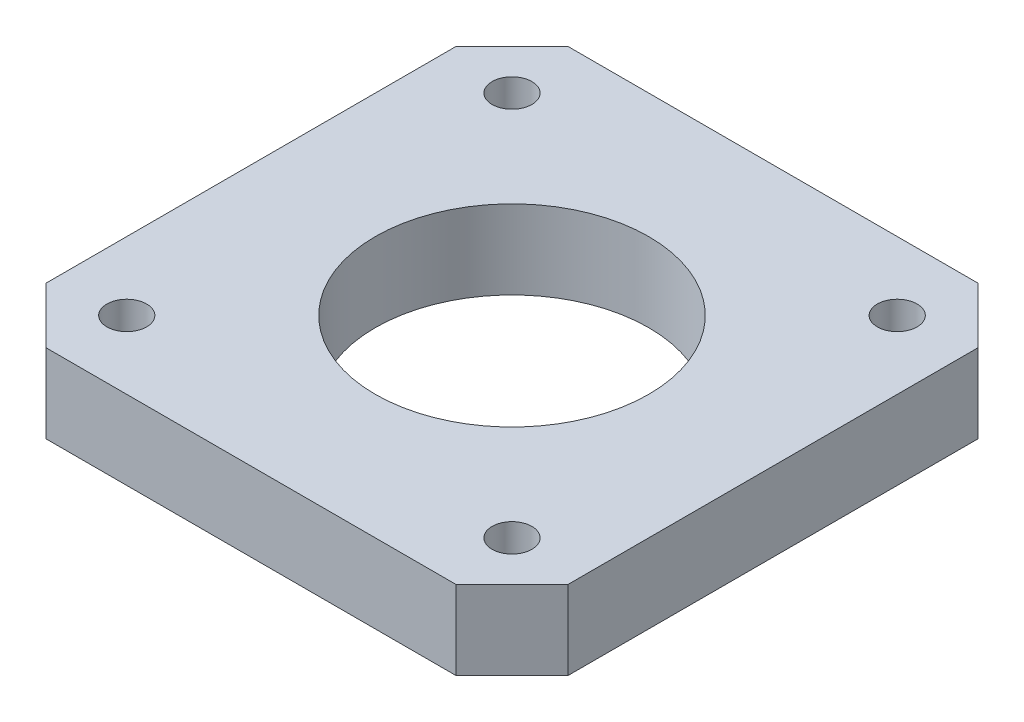
ISO-10303-21;
HEADER;
FILE_DESCRIPTION(('STEP AP214'),'2;1');
FILE_NAME('part.step','',(''),(''),'','','');
FILE_SCHEMA(('AUTOMOTIVE_DESIGN { 1 0 10303 214 1 1 1 1 }'));
ENDSEC;
DATA;
#1=APPLICATION_CONTEXT('core data for automotive mechanical design processes');
#2=APPLICATION_PROTOCOL_DEFINITION('international standard','automotive_design',2000,#1);
#3=PRODUCT_CONTEXT('',#1,'mechanical');
#4=PRODUCT('Part','Part','',(#3));
#5=PRODUCT_RELATED_PRODUCT_CATEGORY('part','',(#4));
#6=PRODUCT_DEFINITION_FORMATION('','',#4);
#7=PRODUCT_DEFINITION_CONTEXT('part definition',#1,'design');
#8=PRODUCT_DEFINITION('design','',#6,#7);
#9=PRODUCT_DEFINITION_SHAPE('','',#8);
#10=(LENGTH_UNIT() NAMED_UNIT(*) SI_UNIT(.MILLI.,.METRE.));
#11=(NAMED_UNIT(*) PLANE_ANGLE_UNIT() SI_UNIT($,.RADIAN.));
#12=(NAMED_UNIT(*) SI_UNIT($,.STERADIAN.) SOLID_ANGLE_UNIT());
#13=UNCERTAINTY_MEASURE_WITH_UNIT(LENGTH_MEASURE(1.E-05),#10,'distance_accuracy_value','');
#14=(GEOMETRIC_REPRESENTATION_CONTEXT(3) GLOBAL_UNCERTAINTY_ASSIGNED_CONTEXT((#13)) GLOBAL_UNIT_ASSIGNED_CONTEXT((#10,
#11,#12)) REPRESENTATION_CONTEXT('',''));
#15=CARTESIAN_POINT('',(0.,0.,0.));
#16=DIRECTION('',(0.,0.,1.));
#17=DIRECTION('',(1.,0.,0.));
#18=AXIS2_PLACEMENT_3D('',#15,#16,#17);
#19=CARTESIAN_POINT('',(-21.,6.35,21.));
#20=DIRECTION('',(0.,0.,-1.));
#21=DIRECTION('',(-1.,0.,0.));
#22=AXIS2_PLACEMENT_3D('',#19,#20,#21);
#23=PLANE('',#22);
#24=DIRECTION('',(1.,0.,0.));
#25=VECTOR('',#24,1.);
#26=CARTESIAN_POINT('',(-21.,0.,21.));
#27=LINE('',#26,#25);
#28=CARTESIAN_POINT('',(-16.5,0.,21.));
#29=VERTEX_POINT('',#28);
#30=CARTESIAN_POINT('',(16.5,0.,21.));
#31=VERTEX_POINT('',#30);
#32=EDGE_CURVE('E128',#29,#31,#27,.T.);
#33=ORIENTED_EDGE('',*,*,#32,.T.);
#34=DIRECTION('',(0.,1.,0.));
#35=VECTOR('',#34,1.);
#36=CARTESIAN_POINT('',(16.5,6.35,21.));
#37=LINE('',#36,#35);
#38=CARTESIAN_POINT('',(16.5,6.35,21.));
#39=VERTEX_POINT('',#38);
#40=EDGE_CURVE('E105',#31,#39,#37,.T.);
#41=ORIENTED_EDGE('',*,*,#40,.T.);
#42=DIRECTION('',(1.,0.,0.));
#43=VECTOR('',#42,1.);
#44=CARTESIAN_POINT('',(-21.,6.35,21.));
#45=LINE('',#44,#43);
#46=CARTESIAN_POINT('',(-16.5,6.35,21.));
#47=VERTEX_POINT('',#46);
#48=EDGE_CURVE('E138',#47,#39,#45,.T.);
#49=ORIENTED_EDGE('',*,*,#48,.F.);
#50=DIRECTION('',(0.,-1.,0.));
#51=VECTOR('',#50,1.);
#52=CARTESIAN_POINT('',(-16.5,6.35,21.));
#53=LINE('',#52,#51);
#54=EDGE_CURVE('E110',#47,#29,#53,.T.);
#55=ORIENTED_EDGE('',*,*,#54,.T.);
#56=EDGE_LOOP('',(#33,#41,#49,#55));
#57=FACE_BOUND('',#56,.T.);
#58=ADVANCED_FACE('F33',(#57),#23,.F.);
#59=CARTESIAN_POINT('',(21.,6.35,21.));
#60=DIRECTION('',(-1.,0.,0.));
#61=DIRECTION('',(0.,0.,1.));
#62=AXIS2_PLACEMENT_3D('',#59,#60,#61);
#63=PLANE('',#62);
#64=DIRECTION('',(0.,0.,-1.));
#65=VECTOR('',#64,1.);
#66=CARTESIAN_POINT('',(21.,6.35,21.));
#67=LINE('',#66,#65);
#68=CARTESIAN_POINT('',(21.,6.35,16.5));
#69=VERTEX_POINT('',#68);
#70=CARTESIAN_POINT('',(21.,6.35,-16.5));
#71=VERTEX_POINT('',#70);
#72=EDGE_CURVE('E120',#69,#71,#67,.T.);
#73=ORIENTED_EDGE('',*,*,#72,.F.);
#74=DIRECTION('',(0.,-1.,0.));
#75=VECTOR('',#74,1.);
#76=CARTESIAN_POINT('',(21.,6.35,16.5));
#77=LINE('',#76,#75);
#78=CARTESIAN_POINT('',(21.,0.,16.5));
#79=VERTEX_POINT('',#78);
#80=EDGE_CURVE('E104',#69,#79,#77,.T.);
#81=ORIENTED_EDGE('',*,*,#80,.T.);
#82=DIRECTION('',(0.,0.,-1.));
#83=VECTOR('',#82,1.);
#84=CARTESIAN_POINT('',(21.,0.,21.));
#85=LINE('',#84,#83);
#86=CARTESIAN_POINT('',(21.,0.,-16.5));
#87=VERTEX_POINT('',#86);
#88=EDGE_CURVE('E117',#79,#87,#85,.T.);
#89=ORIENTED_EDGE('',*,*,#88,.T.);
#90=DIRECTION('',(0.,1.,0.));
#91=VECTOR('',#90,1.);
#92=CARTESIAN_POINT('',(21.,6.35,-16.5));
#93=LINE('',#92,#91);
#94=EDGE_CURVE('E122',#87,#71,#93,.T.);
#95=ORIENTED_EDGE('',*,*,#94,.T.);
#96=EDGE_LOOP('',(#73,#81,#89,#95));
#97=FACE_BOUND('',#96,.T.);
#98=ADVANCED_FACE('F116',(#97),#63,.F.);
#99=CARTESIAN_POINT('',(-21.,6.35,-21.));
#100=DIRECTION('',(0.,0.,1.));
#101=DIRECTION('',(1.,0.,0.));
#102=AXIS2_PLACEMENT_3D('',#99,#100,#101);
#103=PLANE('',#102);
#104=DIRECTION('',(-1.,0.,0.));
#105=VECTOR('',#104,1.);
#106=CARTESIAN_POINT('',(-21.,6.35,-21.));
#107=LINE('',#106,#105);
#108=CARTESIAN_POINT('',(16.5,6.35,-21.));
#109=VERTEX_POINT('',#108);
#110=CARTESIAN_POINT('',(-16.5,6.35,-21.));
#111=VERTEX_POINT('',#110);
#112=EDGE_CURVE('E161',#109,#111,#107,.T.);
#113=ORIENTED_EDGE('',*,*,#112,.F.);
#114=DIRECTION('',(0.,-1.,0.));
#115=VECTOR('',#114,1.);
#116=CARTESIAN_POINT('',(16.5,6.35,-21.));
#117=LINE('',#116,#115);
#118=CARTESIAN_POINT('',(16.5,0.,-21.));
#119=VERTEX_POINT('',#118);
#120=EDGE_CURVE('E11',#109,#119,#117,.T.);
#121=ORIENTED_EDGE('',*,*,#120,.T.);
#122=DIRECTION('',(-1.,0.,0.));
#123=VECTOR('',#122,1.);
#124=CARTESIAN_POINT('',(-21.,0.,-21.));
#125=LINE('',#124,#123);
#126=CARTESIAN_POINT('',(-16.5,0.,-21.));
#127=VERTEX_POINT('',#126);
#128=EDGE_CURVE('E127',#119,#127,#125,.T.);
#129=ORIENTED_EDGE('',*,*,#128,.T.);
#130=DIRECTION('',(0.,1.,0.));
#131=VECTOR('',#130,1.);
#132=CARTESIAN_POINT('',(-16.5,6.35,-21.));
#133=LINE('',#132,#131);
#134=EDGE_CURVE('E41',#127,#111,#133,.T.);
#135=ORIENTED_EDGE('',*,*,#134,.T.);
#136=EDGE_LOOP('',(#113,#121,#129,#135));
#137=FACE_BOUND('',#136,.T.);
#138=ADVANCED_FACE('F160',(#137),#103,.F.);
#139=CARTESIAN_POINT('',(-21.,6.35,21.));
#140=DIRECTION('',(1.,0.,0.));
#141=DIRECTION('',(0.,0.,-1.));
#142=AXIS2_PLACEMENT_3D('',#139,#140,#141);
#143=PLANE('',#142);
#144=DIRECTION('',(0.,0.,1.));
#145=VECTOR('',#144,1.);
#146=CARTESIAN_POINT('',(-21.,0.,21.));
#147=LINE('',#146,#145);
#148=CARTESIAN_POINT('',(-21.,0.,-16.5));
#149=VERTEX_POINT('',#148);
#150=CARTESIAN_POINT('',(-21.,0.,16.5));
#151=VERTEX_POINT('',#150);
#152=EDGE_CURVE('E131',#149,#151,#147,.T.);
#153=ORIENTED_EDGE('',*,*,#152,.T.);
#154=DIRECTION('',(0.,1.,0.));
#155=VECTOR('',#154,1.);
#156=CARTESIAN_POINT('',(-21.,6.35,16.5));
#157=LINE('',#156,#155);
#158=CARTESIAN_POINT('',(-21.,6.35,16.5));
#159=VERTEX_POINT('',#158);
#160=EDGE_CURVE('E48',#151,#159,#157,.T.);
#161=ORIENTED_EDGE('',*,*,#160,.T.);
#162=DIRECTION('',(0.,0.,1.));
#163=VECTOR('',#162,1.);
#164=CARTESIAN_POINT('',(-21.,6.35,21.));
#165=LINE('',#164,#163);
#166=CARTESIAN_POINT('',(-21.,6.35,-16.5));
#167=VERTEX_POINT('',#166);
#168=EDGE_CURVE('E139',#167,#159,#165,.T.);
#169=ORIENTED_EDGE('',*,*,#168,.F.);
#170=DIRECTION('',(0.,-1.,0.));
#171=VECTOR('',#170,1.);
#172=CARTESIAN_POINT('',(-21.,6.35,-16.5));
#173=LINE('',#172,#171);
#174=EDGE_CURVE('E154',#167,#149,#173,.T.);
#175=ORIENTED_EDGE('',*,*,#174,.T.);
#176=EDGE_LOOP('',(#153,#161,#169,#175));
#177=FACE_BOUND('',#176,.T.);
#178=ADVANCED_FACE('F170',(#177),#143,.F.);
#179=CARTESIAN_POINT('',(0.,6.35,0.));
#180=DIRECTION('',(0.,1.,0.));
#181=DIRECTION('',(0.,0.,1.));
#182=AXIS2_PLACEMENT_3D('',#179,#180,#181);
#183=PLANE('',#182);
#184=CARTESIAN_POINT('',(0.,6.35,0.));
#185=DIRECTION('',(0.,1.,0.));
#186=DIRECTION('',(0.,0.,1.));
#187=AXIS2_PLACEMENT_3D('',#184,#185,#186);
#188=CIRCLE('',#187,11.);
#189=CARTESIAN_POINT('',(0.,6.35,11.));
#190=VERTEX_POINT('',#189);
#191=EDGE_CURVE('E204',#190,#190,#188,.T.);
#192=ORIENTED_EDGE('',*,*,#191,.F.);
#193=EDGE_LOOP('',(#192));
#194=FACE_BOUND('',#193,.T.);
#195=CARTESIAN_POINT('',(-15.5,6.35,-15.5));
#196=DIRECTION('',(0.,1.,0.));
#197=DIRECTION('',(0.,0.,1.));
#198=AXIS2_PLACEMENT_3D('',#195,#196,#197);
#199=CIRCLE('',#198,1.59999999999999);
#200=CARTESIAN_POINT('',(-15.5,6.35,-13.9));
#201=VERTEX_POINT('',#200);
#202=EDGE_CURVE('E200',#201,#201,#199,.T.);
#203=ORIENTED_EDGE('',*,*,#202,.F.);
#204=EDGE_LOOP('',(#203));
#205=FACE_BOUND('',#204,.T.);
#206=CARTESIAN_POINT('',(-15.5,6.35,15.5));
#207=DIRECTION('',(0.,1.,0.));
#208=DIRECTION('',(0.,0.,1.));
#209=AXIS2_PLACEMENT_3D('',#206,#207,#208);
#210=CIRCLE('',#209,1.59999999999999);
#211=CARTESIAN_POINT('',(-15.5,6.35,17.1));
#212=VERTEX_POINT('',#211);
#213=EDGE_CURVE('E194',#212,#212,#210,.T.);
#214=ORIENTED_EDGE('',*,*,#213,.F.);
#215=EDGE_LOOP('',(#214));
#216=FACE_BOUND('',#215,.T.);
#217=CARTESIAN_POINT('',(15.5,6.35,15.5));
#218=DIRECTION('',(0.,1.,0.));
#219=DIRECTION('',(0.,0.,1.));
#220=AXIS2_PLACEMENT_3D('',#217,#218,#219);
#221=CIRCLE('',#220,1.59999999999999);
#222=CARTESIAN_POINT('',(15.5,6.35,17.1));
#223=VERTEX_POINT('',#222);
#224=EDGE_CURVE('E188',#223,#223,#221,.T.);
#225=ORIENTED_EDGE('',*,*,#224,.F.);
#226=EDGE_LOOP('',(#225));
#227=FACE_BOUND('',#226,.T.);
#228=CARTESIAN_POINT('',(15.5,6.35,-15.5));
#229=DIRECTION('',(0.,1.,0.));
#230=DIRECTION('',(0.,0.,1.));
#231=AXIS2_PLACEMENT_3D('',#228,#229,#230);
#232=CIRCLE('',#231,1.59999999999999);
#233=CARTESIAN_POINT('',(15.5,6.35,-13.9));
#234=VERTEX_POINT('',#233);
#235=EDGE_CURVE('E182',#234,#234,#232,.T.);
#236=ORIENTED_EDGE('',*,*,#235,.F.);
#237=EDGE_LOOP('',(#236));
#238=FACE_BOUND('',#237,.T.);
#239=ORIENTED_EDGE('',*,*,#48,.T.);
#240=DIRECTION('',(-0.707106781186549,0.,0.707106781186546));
#241=VECTOR('',#240,1.);
#242=CARTESIAN_POINT('',(18.75,6.35,18.75));
#243=LINE('',#242,#241);
#244=EDGE_CURVE('E152',#39,#69,#243,.F.);
#245=ORIENTED_EDGE('',*,*,#244,.T.);
#246=ORIENTED_EDGE('',*,*,#72,.T.);
#247=DIRECTION('',(0.707106781186546,0.,0.707106781186549));
#248=VECTOR('',#247,1.);
#249=CARTESIAN_POINT('',(18.75,6.35,-18.75));
#250=LINE('',#249,#248);
#251=EDGE_CURVE('E148',#71,#109,#250,.F.);
#252=ORIENTED_EDGE('',*,*,#251,.T.);
#253=ORIENTED_EDGE('',*,*,#112,.T.);
#254=DIRECTION('',(0.707106781186549,0.,-0.707106781186546));
#255=VECTOR('',#254,1.);
#256=CARTESIAN_POINT('',(-18.75,6.35,-18.75));
#257=LINE('',#256,#255);
#258=EDGE_CURVE('E55',#111,#167,#257,.F.);
#259=ORIENTED_EDGE('',*,*,#258,.T.);
#260=ORIENTED_EDGE('',*,*,#168,.T.);
#261=DIRECTION('',(-0.707106781186546,0.,-0.707106781186549));
#262=VECTOR('',#261,1.);
#263=CARTESIAN_POINT('',(-18.75,6.35,18.75));
#264=LINE('',#263,#262);
#265=EDGE_CURVE('E150',#159,#47,#264,.F.);
#266=ORIENTED_EDGE('',*,*,#265,.T.);
#267=EDGE_LOOP('',(#239,#245,#246,#252,#253,#259,#260,#266));
#268=FACE_BOUND('',#267,.T.);
#269=ADVANCED_FACE('F165',(#194,#205,#216,#227,#238,#268),#183,.T.);
#270=CARTESIAN_POINT('',(0.,0.,0.));
#271=DIRECTION('',(0.,1.,0.));
#272=DIRECTION('',(0.,0.,1.));
#273=AXIS2_PLACEMENT_3D('',#270,#271,#272);
#274=PLANE('',#273);
#275=CARTESIAN_POINT('',(0.,0.,0.));
#276=DIRECTION('',(0.,1.,0.));
#277=DIRECTION('',(0.,0.,1.));
#278=AXIS2_PLACEMENT_3D('',#275,#276,#277);
#279=CIRCLE('',#278,11.);
#280=CARTESIAN_POINT('',(0.,0.,11.));
#281=VERTEX_POINT('',#280);
#282=EDGE_CURVE('E203',#281,#281,#279,.T.);
#283=ORIENTED_EDGE('',*,*,#282,.T.);
#284=EDGE_LOOP('',(#283));
#285=FACE_BOUND('',#284,.T.);
#286=CARTESIAN_POINT('',(-15.5,0.,-15.5));
#287=DIRECTION('',(0.,1.,0.));
#288=DIRECTION('',(0.,0.,1.));
#289=AXIS2_PLACEMENT_3D('',#286,#287,#288);
#290=CIRCLE('',#289,1.6);
#291=CARTESIAN_POINT('',(-15.5,0.,-13.9));
#292=VERTEX_POINT('',#291);
#293=EDGE_CURVE('E197',#292,#292,#290,.T.);
#294=ORIENTED_EDGE('',*,*,#293,.T.);
#295=EDGE_LOOP('',(#294));
#296=FACE_BOUND('',#295,.T.);
#297=CARTESIAN_POINT('',(-15.5,0.,15.5));
#298=DIRECTION('',(0.,1.,0.));
#299=DIRECTION('',(0.,0.,1.));
#300=AXIS2_PLACEMENT_3D('',#297,#298,#299);
#301=CIRCLE('',#300,1.6);
#302=CARTESIAN_POINT('',(-15.5,0.,17.1));
#303=VERTEX_POINT('',#302);
#304=EDGE_CURVE('E191',#303,#303,#301,.T.);
#305=ORIENTED_EDGE('',*,*,#304,.T.);
#306=EDGE_LOOP('',(#305));
#307=FACE_BOUND('',#306,.T.);
#308=CARTESIAN_POINT('',(15.5,0.,15.5));
#309=DIRECTION('',(0.,1.,0.));
#310=DIRECTION('',(0.,0.,1.));
#311=AXIS2_PLACEMENT_3D('',#308,#309,#310);
#312=CIRCLE('',#311,1.6);
#313=CARTESIAN_POINT('',(15.5,0.,17.1));
#314=VERTEX_POINT('',#313);
#315=EDGE_CURVE('E185',#314,#314,#312,.T.);
#316=ORIENTED_EDGE('',*,*,#315,.T.);
#317=EDGE_LOOP('',(#316));
#318=FACE_BOUND('',#317,.T.);
#319=CARTESIAN_POINT('',(15.5,0.,-15.5));
#320=DIRECTION('',(0.,1.,0.));
#321=DIRECTION('',(0.,0.,1.));
#322=AXIS2_PLACEMENT_3D('',#319,#320,#321);
#323=CIRCLE('',#322,1.6);
#324=CARTESIAN_POINT('',(15.5,0.,-13.9));
#325=VERTEX_POINT('',#324);
#326=EDGE_CURVE('E133',#325,#325,#323,.T.);
#327=ORIENTED_EDGE('',*,*,#326,.T.);
#328=EDGE_LOOP('',(#327));
#329=FACE_BOUND('',#328,.T.);
#330=ORIENTED_EDGE('',*,*,#88,.F.);
#331=DIRECTION('',(0.707106781186549,0.,-0.707106781186546));
#332=VECTOR('',#331,1.);
#333=CARTESIAN_POINT('',(21.,0.,16.5));
#334=LINE('',#333,#332);
#335=EDGE_CURVE('E100',#79,#31,#334,.F.);
#336=ORIENTED_EDGE('',*,*,#335,.T.);
#337=ORIENTED_EDGE('',*,*,#32,.F.);
#338=DIRECTION('',(0.707106781186546,0.,0.707106781186549));
#339=VECTOR('',#338,1.);
#340=CARTESIAN_POINT('',(-16.5,0.,21.));
#341=LINE('',#340,#339);
#342=EDGE_CURVE('E111',#29,#151,#341,.F.);
#343=ORIENTED_EDGE('',*,*,#342,.T.);
#344=ORIENTED_EDGE('',*,*,#152,.F.);
#345=DIRECTION('',(-0.707106781186549,0.,0.707106781186546));
#346=VECTOR('',#345,1.);
#347=CARTESIAN_POINT('',(-21.,0.,-16.5));
#348=LINE('',#347,#346);
#349=EDGE_CURVE('E121',#149,#127,#348,.F.);
#350=ORIENTED_EDGE('',*,*,#349,.T.);
#351=ORIENTED_EDGE('',*,*,#128,.F.);
#352=DIRECTION('',(-0.707106781186546,0.,-0.707106781186549));
#353=VECTOR('',#352,1.);
#354=CARTESIAN_POINT('',(16.5,0.,-21.));
#355=LINE('',#354,#353);
#356=EDGE_CURVE('E126',#119,#87,#355,.F.);
#357=ORIENTED_EDGE('',*,*,#356,.T.);
#358=EDGE_LOOP('',(#330,#336,#337,#343,#344,#350,#351,#357));
#359=FACE_BOUND('',#358,.T.);
#360=ADVANCED_FACE('F124',(#285,#296,#307,#318,#329,#359),#274,.F.);
#361=CARTESIAN_POINT('',(21.,6.35,16.5));
#362=DIRECTION('',(-0.707106781186546,0.,-0.707106781186549));
#363=DIRECTION('',(0.,-1.,0.));
#364=AXIS2_PLACEMENT_3D('',#361,#362,#363);
#365=PLANE('',#364);
#366=ORIENTED_EDGE('',*,*,#244,.F.);
#367=ORIENTED_EDGE('',*,*,#40,.F.);
#368=ORIENTED_EDGE('',*,*,#335,.F.);
#369=ORIENTED_EDGE('',*,*,#80,.F.);
#370=EDGE_LOOP('',(#366,#367,#368,#369));
#371=FACE_BOUND('',#370,.T.);
#372=ADVANCED_FACE('F103',(#371),#365,.F.);
#373=CARTESIAN_POINT('',(-16.5,6.35,21.));
#374=DIRECTION('',(0.707106781186549,0.,-0.707106781186546));
#375=DIRECTION('',(0.,-1.,0.));
#376=AXIS2_PLACEMENT_3D('',#373,#374,#375);
#377=PLANE('',#376);
#378=ORIENTED_EDGE('',*,*,#265,.F.);
#379=ORIENTED_EDGE('',*,*,#160,.F.);
#380=ORIENTED_EDGE('',*,*,#342,.F.);
#381=ORIENTED_EDGE('',*,*,#54,.F.);
#382=EDGE_LOOP('',(#378,#379,#380,#381));
#383=FACE_BOUND('',#382,.T.);
#384=ADVANCED_FACE('F174',(#383),#377,.F.);
#385=CARTESIAN_POINT('',(16.5,6.35,-21.));
#386=DIRECTION('',(-0.707106781186549,0.,0.707106781186546));
#387=DIRECTION('',(0.,-1.,0.));
#388=AXIS2_PLACEMENT_3D('',#385,#386,#387);
#389=PLANE('',#388);
#390=ORIENTED_EDGE('',*,*,#251,.F.);
#391=ORIENTED_EDGE('',*,*,#94,.F.);
#392=ORIENTED_EDGE('',*,*,#356,.F.);
#393=ORIENTED_EDGE('',*,*,#120,.F.);
#394=EDGE_LOOP('',(#390,#391,#392,#393));
#395=FACE_BOUND('',#394,.T.);
#396=ADVANCED_FACE('F242',(#395),#389,.F.);
#397=CARTESIAN_POINT('',(-21.,6.35,-16.5));
#398=DIRECTION('',(0.707106781186546,0.,0.707106781186549));
#399=DIRECTION('',(0.,-1.,0.));
#400=AXIS2_PLACEMENT_3D('',#397,#398,#399);
#401=PLANE('',#400);
#402=ORIENTED_EDGE('',*,*,#258,.F.);
#403=ORIENTED_EDGE('',*,*,#134,.F.);
#404=ORIENTED_EDGE('',*,*,#349,.F.);
#405=ORIENTED_EDGE('',*,*,#174,.F.);
#406=EDGE_LOOP('',(#402,#403,#404,#405));
#407=FACE_BOUND('',#406,.T.);
#408=ADVANCED_FACE('F35',(#407),#401,.F.);
#409=CARTESIAN_POINT('',(15.5,6.35,-15.5));
#410=DIRECTION('',(0.,1.,0.));
#411=DIRECTION('',(0.,0.,1.));
#412=AXIS2_PLACEMENT_3D('',#409,#410,#411);
#413=CYLINDRICAL_SURFACE('',#412,1.59999999999999);
#414=ORIENTED_EDGE('',*,*,#326,.F.);
#415=EDGE_LOOP('',(#414));
#416=FACE_BOUND('',#415,.T.);
#417=ORIENTED_EDGE('',*,*,#235,.T.);
#418=EDGE_LOOP('',(#417));
#419=FACE_BOUND('',#418,.T.);
#420=ADVANCED_FACE('F230',(#416,#419),#413,.F.);
#421=CARTESIAN_POINT('',(15.5,6.35,15.5));
#422=DIRECTION('',(0.,1.,0.));
#423=DIRECTION('',(0.,0.,1.));
#424=AXIS2_PLACEMENT_3D('',#421,#422,#423);
#425=CYLINDRICAL_SURFACE('',#424,1.59999999999999);
#426=ORIENTED_EDGE('',*,*,#315,.F.);
#427=EDGE_LOOP('',(#426));
#428=FACE_BOUND('',#427,.T.);
#429=ORIENTED_EDGE('',*,*,#224,.T.);
#430=EDGE_LOOP('',(#429));
#431=FACE_BOUND('',#430,.T.);
#432=ADVANCED_FACE('F232',(#428,#431),#425,.F.);
#433=CARTESIAN_POINT('',(-15.5,6.35,15.5));
#434=DIRECTION('',(0.,1.,0.));
#435=DIRECTION('',(0.,0.,1.));
#436=AXIS2_PLACEMENT_3D('',#433,#434,#435);
#437=CYLINDRICAL_SURFACE('',#436,1.59999999999999);
#438=ORIENTED_EDGE('',*,*,#304,.F.);
#439=EDGE_LOOP('',(#438));
#440=FACE_BOUND('',#439,.T.);
#441=ORIENTED_EDGE('',*,*,#213,.T.);
#442=EDGE_LOOP('',(#441));
#443=FACE_BOUND('',#442,.T.);
#444=ADVANCED_FACE('F239',(#440,#443),#437,.F.);
#445=CARTESIAN_POINT('',(-15.5,6.35,-15.5));
#446=DIRECTION('',(0.,1.,0.));
#447=DIRECTION('',(0.,0.,1.));
#448=AXIS2_PLACEMENT_3D('',#445,#446,#447);
#449=CYLINDRICAL_SURFACE('',#448,1.59999999999999);
#450=ORIENTED_EDGE('',*,*,#293,.F.);
#451=EDGE_LOOP('',(#450));
#452=FACE_BOUND('',#451,.T.);
#453=ORIENTED_EDGE('',*,*,#202,.T.);
#454=EDGE_LOOP('',(#453));
#455=FACE_BOUND('',#454,.T.);
#456=ADVANCED_FACE('F215',(#452,#455),#449,.F.);
#457=CARTESIAN_POINT('',(0.,0.,0.));
#458=DIRECTION('',(0.,1.,0.));
#459=DIRECTION('',(0.,0.,1.));
#460=AXIS2_PLACEMENT_3D('',#457,#458,#459);
#461=CYLINDRICAL_SURFACE('',#460,11.);
#462=ORIENTED_EDGE('',*,*,#282,.F.);
#463=EDGE_LOOP('',(#462));
#464=FACE_BOUND('',#463,.T.);
#465=ORIENTED_EDGE('',*,*,#191,.T.);
#466=EDGE_LOOP('',(#465));
#467=FACE_BOUND('',#466,.T.);
#468=ADVANCED_FACE('F212',(#464,#467),#461,.F.);
#469=CLOSED_SHELL('',(#58,#98,#138,#178,#269,#360,#372,#384,#396,#408,#420,#432,#444,#456,#468));
#470=MANIFOLD_SOLID_BREP('B2',#469);
#471=ADVANCED_BREP_SHAPE_REPRESENTATION('',(#18,#470),#14);
#472=SHAPE_DEFINITION_REPRESENTATION(#9,#471);
ENDSEC;
END-ISO-10303-21;
